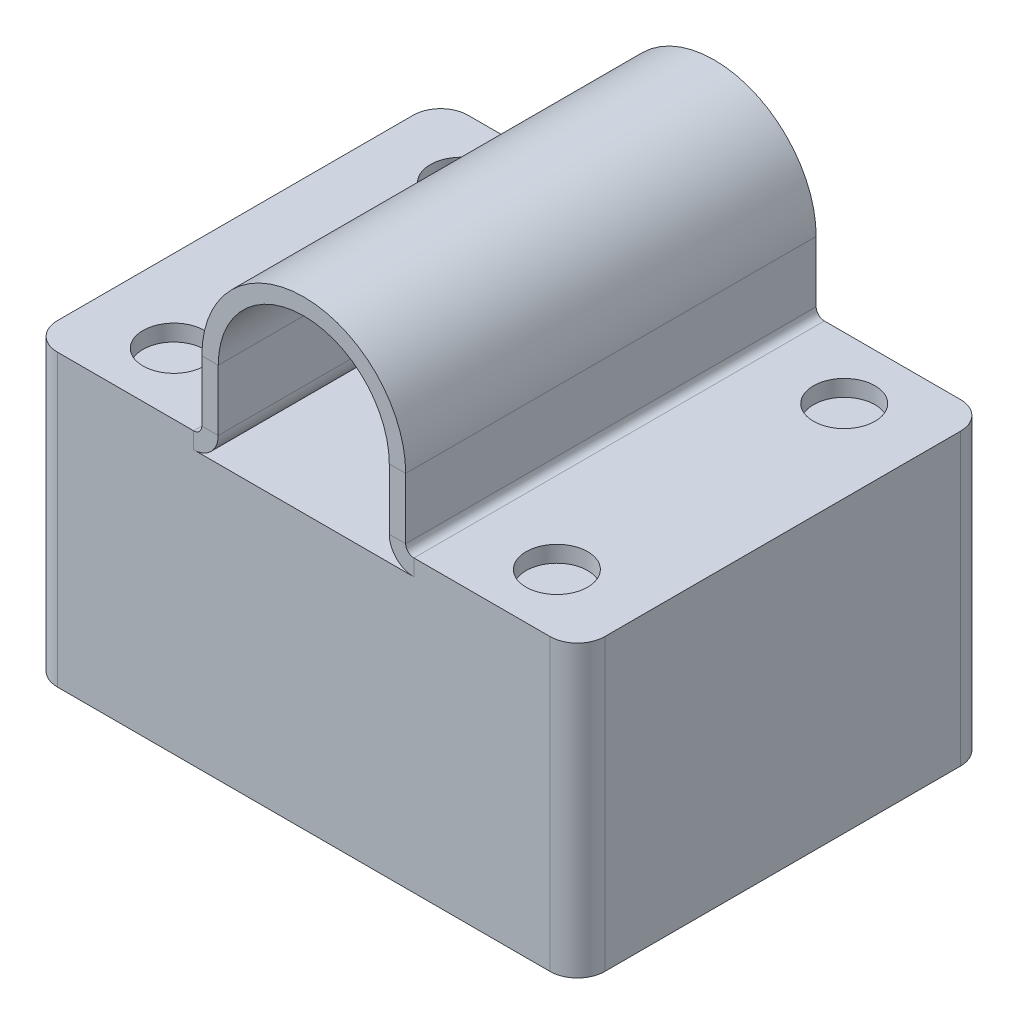
ISO-10303-21;
HEADER;
FILE_DESCRIPTION(('STEP AP214'),'2;1');
FILE_NAME('part.step','',(''),(''),'','','');
FILE_SCHEMA(('AUTOMOTIVE_DESIGN { 1 0 10303 214 1 1 1 1 }'));
ENDSEC;
DATA;
#1=APPLICATION_CONTEXT('core data for automotive mechanical design processes');
#2=APPLICATION_PROTOCOL_DEFINITION('international standard','automotive_design',2000,#1);
#3=PRODUCT_CONTEXT('',#1,'mechanical');
#4=PRODUCT('Part','Part','',(#3));
#5=PRODUCT_RELATED_PRODUCT_CATEGORY('part','',(#4));
#6=PRODUCT_DEFINITION_FORMATION('','',#4);
#7=PRODUCT_DEFINITION_CONTEXT('part definition',#1,'design');
#8=PRODUCT_DEFINITION('design','',#6,#7);
#9=PRODUCT_DEFINITION_SHAPE('','',#8);
#10=(LENGTH_UNIT() NAMED_UNIT(*) SI_UNIT(.MILLI.,.METRE.));
#11=(NAMED_UNIT(*) PLANE_ANGLE_UNIT() SI_UNIT($,.RADIAN.));
#12=(NAMED_UNIT(*) SI_UNIT($,.STERADIAN.) SOLID_ANGLE_UNIT());
#13=UNCERTAINTY_MEASURE_WITH_UNIT(LENGTH_MEASURE(1.E-05),#10,'distance_accuracy_value','');
#14=(GEOMETRIC_REPRESENTATION_CONTEXT(3) GLOBAL_UNCERTAINTY_ASSIGNED_CONTEXT((#13)) GLOBAL_UNIT_ASSIGNED_CONTEXT((#10,
#11,#12)) REPRESENTATION_CONTEXT('',''));
#15=CARTESIAN_POINT('',(0.,0.,0.));
#16=DIRECTION('',(0.,0.,1.));
#17=DIRECTION('',(1.,0.,0.));
#18=AXIS2_PLACEMENT_3D('',#15,#16,#17);
#19=CARTESIAN_POINT('',(0.,6.25,15.));
#20=DIRECTION('',(0.,0.,-1.));
#21=DIRECTION('',(-1.,0.,0.));
#22=AXIS2_PLACEMENT_3D('',#19,#20,#21);
#23=PLANE('',#22);
#24=DIRECTION('',(-1.,0.,0.));
#25=VECTOR('',#24,1.);
#26=CARTESIAN_POINT('',(-7.45,6.25,15.));
#27=LINE('',#26,#25);
#28=CARTESIAN_POINT('',(-6.25,6.25,15.));
#29=VERTEX_POINT('',#28);
#30=CARTESIAN_POINT('',(-7.45,6.25,15.));
#31=VERTEX_POINT('',#30);
#32=EDGE_CURVE('E457',#29,#31,#27,.T.);
#33=ORIENTED_EDGE('',*,*,#32,.F.);
#34=CARTESIAN_POINT('',(0.,6.25,15.));
#35=DIRECTION('',(0.,0.,1.));
#36=DIRECTION('',(1.,0.,0.));
#37=AXIS2_PLACEMENT_3D('',#34,#35,#36);
#38=CIRCLE('',#37,6.25);
#39=CARTESIAN_POINT('',(6.25,6.25,15.));
#40=VERTEX_POINT('',#39);
#41=EDGE_CURVE('E367',#40,#29,#38,.T.);
#42=ORIENTED_EDGE('',*,*,#41,.F.);
#43=DIRECTION('',(1.,0.,0.));
#44=VECTOR('',#43,1.);
#45=CARTESIAN_POINT('',(7.45,6.25,15.));
#46=LINE('',#45,#44);
#47=CARTESIAN_POINT('',(7.45,6.25,15.));
#48=VERTEX_POINT('',#47);
#49=EDGE_CURVE('E454',#40,#48,#46,.T.);
#50=ORIENTED_EDGE('',*,*,#49,.T.);
#51=CARTESIAN_POINT('',(0.,6.25,15.));
#52=DIRECTION('',(0.,0.,1.));
#53=DIRECTION('',(1.,0.,0.));
#54=AXIS2_PLACEMENT_3D('',#51,#52,#53);
#55=CIRCLE('',#54,7.45);
#56=EDGE_CURVE('E331',#48,#31,#55,.T.);
#57=ORIENTED_EDGE('',*,*,#56,.T.);
#58=EDGE_LOOP('',(#33,#42,#50,#57));
#59=FACE_BOUND('',#58,.T.);
#60=ADVANCED_FACE('F47',(#59),#23,.F.);
#61=CARTESIAN_POINT('',(7.45,6.25,15.));
#62=DIRECTION('',(0.,0.,-1.));
#63=DIRECTION('',(0.,1.,0.));
#64=AXIS2_PLACEMENT_3D('',#61,#62,#63);
#65=PLANE('',#64);
#66=ORIENTED_EDGE('',*,*,#49,.F.);
#67=DIRECTION('',(0.,1.,0.));
#68=VECTOR('',#67,1.);
#69=CARTESIAN_POINT('',(6.25,6.25,15.));
#70=LINE('',#69,#68);
#71=CARTESIAN_POINT('',(6.25,1.8,15.));
#72=VERTEX_POINT('',#71);
#73=EDGE_CURVE('E390',#72,#40,#70,.T.);
#74=ORIENTED_EDGE('',*,*,#73,.F.);
#75=DIRECTION('',(1.,0.,0.));
#76=VECTOR('',#75,1.);
#77=CARTESIAN_POINT('',(7.45,1.8,15.));
#78=LINE('',#77,#76);
#79=CARTESIAN_POINT('',(7.45,1.8,15.));
#80=VERTEX_POINT('',#79);
#81=EDGE_CURVE('E451',#72,#80,#78,.T.);
#82=ORIENTED_EDGE('',*,*,#81,.T.);
#83=DIRECTION('',(0.,1.,0.));
#84=VECTOR('',#83,1.);
#85=CARTESIAN_POINT('',(7.45,6.25,15.));
#86=LINE('',#85,#84);
#87=EDGE_CURVE('E291',#80,#48,#86,.T.);
#88=ORIENTED_EDGE('',*,*,#87,.T.);
#89=EDGE_LOOP('',(#66,#74,#82,#88));
#90=FACE_BOUND('',#89,.T.);
#91=ADVANCED_FACE('F552',(#90),#65,.F.);
#92=CARTESIAN_POINT('',(8.05,1.8,15.));
#93=DIRECTION('',(0.,0.,-1.));
#94=DIRECTION('',(-1.,0.,0.));
#95=AXIS2_PLACEMENT_3D('',#92,#93,#94);
#96=PLANE('',#95);
#97=ORIENTED_EDGE('',*,*,#81,.F.);
#98=CARTESIAN_POINT('',(8.05,1.8,15.));
#99=DIRECTION('',(0.,0.,1.));
#100=DIRECTION('',(1.,0.,0.));
#101=AXIS2_PLACEMENT_3D('',#98,#99,#100);
#102=CIRCLE('',#101,1.8);
#103=CARTESIAN_POINT('',(8.05,0.,15.));
#104=VERTEX_POINT('',#103);
#105=EDGE_CURVE('E384',#104,#72,#102,.F.);
#106=ORIENTED_EDGE('',*,*,#105,.F.);
#107=DIRECTION('',(0.,1.,0.));
#108=VECTOR('',#107,1.);
#109=CARTESIAN_POINT('',(8.05,1.2,15.));
#110=LINE('',#109,#108);
#111=CARTESIAN_POINT('',(8.05,1.2,15.));
#112=VERTEX_POINT('',#111);
#113=EDGE_CURVE('E447',#104,#112,#110,.T.);
#114=ORIENTED_EDGE('',*,*,#113,.T.);
#115=CARTESIAN_POINT('',(8.05,1.8,15.));
#116=DIRECTION('',(0.,0.,1.));
#117=DIRECTION('',(1.,0.,0.));
#118=AXIS2_PLACEMENT_3D('',#115,#116,#117);
#119=CIRCLE('',#118,0.599999999999999);
#120=EDGE_CURVE('E307',#112,#80,#119,.F.);
#121=ORIENTED_EDGE('',*,*,#120,.T.);
#122=EDGE_LOOP('',(#97,#106,#114,#121));
#123=FACE_BOUND('',#122,.T.);
#124=ADVANCED_FACE('F533',(#123),#96,.F.);
#125=CARTESIAN_POINT('',(20.,1.2,-15.));
#126=DIRECTION('',(-1.,0.,0.));
#127=DIRECTION('',(0.,0.,1.));
#128=AXIS2_PLACEMENT_3D('',#125,#126,#127);
#129=PLANE('',#128);
#130=DIRECTION('',(0.,1.,0.));
#131=VECTOR('',#130,1.);
#132=CARTESIAN_POINT('',(20.,1.2,13.));
#133=LINE('',#132,#131);
#134=CARTESIAN_POINT('',(20.,1.2,13.));
#135=VERTEX_POINT('',#134);
#136=CARTESIAN_POINT('',(20.,-20.,13.));
#137=VERTEX_POINT('',#136);
#138=EDGE_CURVE('E195',#135,#137,#133,.F.);
#139=ORIENTED_EDGE('',*,*,#138,.T.);
#140=DIRECTION('',(0.,0.,1.));
#141=VECTOR('',#140,1.);
#142=CARTESIAN_POINT('',(20.,-20.,13.));
#143=LINE('',#142,#141);
#144=CARTESIAN_POINT('',(20.,-20.,-13.));
#145=VERTEX_POINT('',#144);
#146=EDGE_CURVE('E218',#145,#137,#143,.T.);
#147=ORIENTED_EDGE('',*,*,#146,.F.);
#148=DIRECTION('',(0.,-1.,0.));
#149=VECTOR('',#148,1.);
#150=CARTESIAN_POINT('',(20.,1.2,-13.));
#151=LINE('',#150,#149);
#152=CARTESIAN_POINT('',(20.,1.2,-13.));
#153=VERTEX_POINT('',#152);
#154=EDGE_CURVE('E478',#145,#153,#151,.F.);
#155=ORIENTED_EDGE('',*,*,#154,.T.);
#156=DIRECTION('',(0.,0.,1.));
#157=VECTOR('',#156,1.);
#158=CARTESIAN_POINT('',(20.,1.2,-15.));
#159=LINE('',#158,#157);
#160=EDGE_CURVE('E279',#153,#135,#159,.T.);
#161=ORIENTED_EDGE('',*,*,#160,.T.);
#162=EDGE_LOOP('',(#139,#147,#155,#161));
#163=FACE_BOUND('',#162,.T.);
#164=ADVANCED_FACE('F489',(#163),#129,.F.);
#165=CARTESIAN_POINT('',(8.05,1.8,-15.));
#166=DIRECTION('',(0.,0.,-1.));
#167=DIRECTION('',(-1.,0.,0.));
#168=AXIS2_PLACEMENT_3D('',#165,#166,#167);
#169=PLANE('',#168);
#170=DIRECTION('',(0.,1.,0.));
#171=VECTOR('',#170,1.);
#172=CARTESIAN_POINT('',(8.05,1.2,-15.));
#173=LINE('',#172,#171);
#174=CARTESIAN_POINT('',(8.05,0.,-15.));
#175=VERTEX_POINT('',#174);
#176=CARTESIAN_POINT('',(8.05,1.2,-15.));
#177=VERTEX_POINT('',#176);
#178=EDGE_CURVE('E443',#175,#177,#173,.T.);
#179=ORIENTED_EDGE('',*,*,#178,.F.);
#180=CARTESIAN_POINT('',(8.05,1.8,-15.));
#181=DIRECTION('',(0.,0.,1.));
#182=DIRECTION('',(1.,0.,0.));
#183=AXIS2_PLACEMENT_3D('',#180,#181,#182);
#184=CIRCLE('',#183,1.8);
#185=CARTESIAN_POINT('',(6.25,1.8,-15.));
#186=VERTEX_POINT('',#185);
#187=EDGE_CURVE('E409',#175,#186,#184,.F.);
#188=ORIENTED_EDGE('',*,*,#187,.T.);
#189=DIRECTION('',(1.,0.,0.));
#190=VECTOR('',#189,1.);
#191=CARTESIAN_POINT('',(7.45,1.8,-15.));
#192=LINE('',#191,#190);
#193=CARTESIAN_POINT('',(7.45,1.8,-15.));
#194=VERTEX_POINT('',#193);
#195=EDGE_CURVE('E440',#186,#194,#192,.T.);
#196=ORIENTED_EDGE('',*,*,#195,.T.);
#197=CARTESIAN_POINT('',(8.05,1.8,-15.));
#198=DIRECTION('',(0.,0.,1.));
#199=DIRECTION('',(1.,0.,0.));
#200=AXIS2_PLACEMENT_3D('',#197,#198,#199);
#201=CIRCLE('',#200,0.599999999999999);
#202=EDGE_CURVE('E311',#177,#194,#201,.F.);
#203=ORIENTED_EDGE('',*,*,#202,.F.);
#204=EDGE_LOOP('',(#179,#188,#196,#203));
#205=FACE_BOUND('',#204,.T.);
#206=ADVANCED_FACE('F526',(#205),#169,.T.);
#207=CARTESIAN_POINT('',(7.45,6.25,-15.));
#208=DIRECTION('',(0.,0.,-1.));
#209=DIRECTION('',(0.,1.,0.));
#210=AXIS2_PLACEMENT_3D('',#207,#208,#209);
#211=PLANE('',#210);
#212=ORIENTED_EDGE('',*,*,#195,.F.);
#213=DIRECTION('',(0.,1.,0.));
#214=VECTOR('',#213,1.);
#215=CARTESIAN_POINT('',(6.25,6.25,-15.));
#216=LINE('',#215,#214);
#217=CARTESIAN_POINT('',(6.25,6.25,-15.));
#218=VERTEX_POINT('',#217);
#219=EDGE_CURVE('E385',#186,#218,#216,.T.);
#220=ORIENTED_EDGE('',*,*,#219,.T.);
#221=DIRECTION('',(1.,0.,0.));
#222=VECTOR('',#221,1.);
#223=CARTESIAN_POINT('',(7.45,6.25,-15.));
#224=LINE('',#223,#222);
#225=CARTESIAN_POINT('',(7.45,6.25,-15.));
#226=VERTEX_POINT('',#225);
#227=EDGE_CURVE('E437',#218,#226,#224,.T.);
#228=ORIENTED_EDGE('',*,*,#227,.T.);
#229=DIRECTION('',(0.,1.,0.));
#230=VECTOR('',#229,1.);
#231=CARTESIAN_POINT('',(7.45,6.25,-15.));
#232=LINE('',#231,#230);
#233=EDGE_CURVE('E299',#194,#226,#232,.T.);
#234=ORIENTED_EDGE('',*,*,#233,.F.);
#235=EDGE_LOOP('',(#212,#220,#228,#234));
#236=FACE_BOUND('',#235,.T.);
#237=ADVANCED_FACE('F545',(#236),#211,.T.);
#238=CARTESIAN_POINT('',(0.,6.25,-15.));
#239=DIRECTION('',(0.,0.,-1.));
#240=DIRECTION('',(-1.,0.,0.));
#241=AXIS2_PLACEMENT_3D('',#238,#239,#240);
#242=PLANE('',#241);
#243=ORIENTED_EDGE('',*,*,#227,.F.);
#244=CARTESIAN_POINT('',(0.,6.25,-15.));
#245=DIRECTION('',(0.,0.,1.));
#246=DIRECTION('',(1.,0.,0.));
#247=AXIS2_PLACEMENT_3D('',#244,#245,#246);
#248=CIRCLE('',#247,6.25);
#249=CARTESIAN_POINT('',(-6.25,6.25,-15.));
#250=VERTEX_POINT('',#249);
#251=EDGE_CURVE('E374',#218,#250,#248,.T.);
#252=ORIENTED_EDGE('',*,*,#251,.T.);
#253=DIRECTION('',(-1.,0.,0.));
#254=VECTOR('',#253,1.);
#255=CARTESIAN_POINT('',(-7.45,6.25,-15.));
#256=LINE('',#255,#254);
#257=CARTESIAN_POINT('',(-7.45,6.25,-15.));
#258=VERTEX_POINT('',#257);
#259=EDGE_CURVE('E434',#250,#258,#256,.T.);
#260=ORIENTED_EDGE('',*,*,#259,.T.);
#261=CARTESIAN_POINT('',(0.,6.25,-15.));
#262=DIRECTION('',(0.,0.,1.));
#263=DIRECTION('',(1.,0.,0.));
#264=AXIS2_PLACEMENT_3D('',#261,#262,#263);
#265=CIRCLE('',#264,7.45);
#266=EDGE_CURVE('E335',#226,#258,#265,.T.);
#267=ORIENTED_EDGE('',*,*,#266,.F.);
#268=EDGE_LOOP('',(#243,#252,#260,#267));
#269=FACE_BOUND('',#268,.T.);
#270=ADVANCED_FACE('F963',(#269),#242,.T.);
#271=CARTESIAN_POINT('',(-7.45,6.25,-15.));
#272=DIRECTION('',(0.,0.,-1.));
#273=DIRECTION('',(0.,-1.,0.));
#274=AXIS2_PLACEMENT_3D('',#271,#272,#273);
#275=PLANE('',#274);
#276=ORIENTED_EDGE('',*,*,#259,.F.);
#277=DIRECTION('',(0.,-1.,0.));
#278=VECTOR('',#277,1.);
#279=CARTESIAN_POINT('',(-6.25,6.25,-15.));
#280=LINE('',#279,#278);
#281=CARTESIAN_POINT('',(-6.25,1.8,-15.));
#282=VERTEX_POINT('',#281);
#283=EDGE_CURVE('E368',#250,#282,#280,.T.);
#284=ORIENTED_EDGE('',*,*,#283,.T.);
#285=DIRECTION('',(-1.,0.,0.));
#286=VECTOR('',#285,1.);
#287=CARTESIAN_POINT('',(-7.45,1.8,-15.));
#288=LINE('',#287,#286);
#289=CARTESIAN_POINT('',(-7.45,1.8,-15.));
#290=VERTEX_POINT('',#289);
#291=EDGE_CURVE('E431',#282,#290,#288,.T.);
#292=ORIENTED_EDGE('',*,*,#291,.T.);
#293=DIRECTION('',(0.,-1.,0.));
#294=VECTOR('',#293,1.);
#295=CARTESIAN_POINT('',(-7.45,6.25,-15.));
#296=LINE('',#295,#294);
#297=EDGE_CURVE('E323',#258,#290,#296,.T.);
#298=ORIENTED_EDGE('',*,*,#297,.F.);
#299=EDGE_LOOP('',(#276,#284,#292,#298));
#300=FACE_BOUND('',#299,.T.);
#301=ADVANCED_FACE('F953',(#300),#275,.T.);
#302=CARTESIAN_POINT('',(-8.05,1.8,-15.));
#303=DIRECTION('',(0.,0.,-1.));
#304=DIRECTION('',(-1.,0.,0.));
#305=AXIS2_PLACEMENT_3D('',#302,#303,#304);
#306=PLANE('',#305);
#307=ORIENTED_EDGE('',*,*,#291,.F.);
#308=CARTESIAN_POINT('',(-8.05,1.8,-15.));
#309=DIRECTION('',(0.,0.,1.));
#310=DIRECTION('',(1.,0.,0.));
#311=AXIS2_PLACEMENT_3D('',#308,#309,#310);
#312=CIRCLE('',#311,1.8);
#313=CARTESIAN_POINT('',(-8.05,0.,-15.));
#314=VERTEX_POINT('',#313);
#315=EDGE_CURVE('E280',#282,#314,#312,.F.);
#316=ORIENTED_EDGE('',*,*,#315,.T.);
#317=DIRECTION('',(0.,1.,0.));
#318=VECTOR('',#317,1.);
#319=CARTESIAN_POINT('',(-8.05,1.2,-15.));
#320=LINE('',#319,#318);
#321=CARTESIAN_POINT('',(-8.05,1.2,-15.));
#322=VERTEX_POINT('',#321);
#323=EDGE_CURVE('E428',#314,#322,#320,.T.);
#324=ORIENTED_EDGE('',*,*,#323,.T.);
#325=CARTESIAN_POINT('',(-8.05,1.8,-15.));
#326=DIRECTION('',(0.,0.,1.));
#327=DIRECTION('',(1.,0.,0.));
#328=AXIS2_PLACEMENT_3D('',#325,#326,#327);
#329=CIRCLE('',#328,0.599999999999999);
#330=EDGE_CURVE('E358',#290,#322,#329,.F.);
#331=ORIENTED_EDGE('',*,*,#330,.F.);
#332=EDGE_LOOP('',(#307,#316,#324,#331));
#333=FACE_BOUND('',#332,.T.);
#334=ADVANCED_FACE('F514',(#333),#306,.T.);
#335=CARTESIAN_POINT('',(-20.,1.2,-15.));
#336=DIRECTION('',(0.,0.,1.));
#337=DIRECTION('',(1.,0.,0.));
#338=AXIS2_PLACEMENT_3D('',#335,#336,#337);
#339=PLANE('',#338);
#340=ORIENTED_EDGE('',*,*,#323,.F.);
#341=DIRECTION('',(-1.,0.,0.));
#342=VECTOR('',#341,1.);
#343=CARTESIAN_POINT('',(-8.05,0.,-15.));
#344=LINE('',#343,#342);
#345=EDGE_CURVE('E239',#175,#314,#344,.T.);
#346=ORIENTED_EDGE('',*,*,#345,.F.);
#347=ORIENTED_EDGE('',*,*,#178,.T.);
#348=DIRECTION('',(1.,0.,0.));
#349=VECTOR('',#348,1.);
#350=CARTESIAN_POINT('',(20.,1.2,-15.));
#351=LINE('',#350,#349);
#352=CARTESIAN_POINT('',(18.,1.2,-15.));
#353=VERTEX_POINT('',#352);
#354=EDGE_CURVE('E284',#353,#177,#351,.F.);
#355=ORIENTED_EDGE('',*,*,#354,.F.);
#356=DIRECTION('',(0.,-1.,0.));
#357=VECTOR('',#356,1.);
#358=CARTESIAN_POINT('',(18.,1.2,-15.));
#359=LINE('',#358,#357);
#360=CARTESIAN_POINT('',(18.,-20.,-15.));
#361=VERTEX_POINT('',#360);
#362=EDGE_CURVE('E56',#353,#361,#359,.T.);
#363=ORIENTED_EDGE('',*,*,#362,.T.);
#364=DIRECTION('',(1.,0.,0.));
#365=VECTOR('',#364,1.);
#366=CARTESIAN_POINT('',(18.,-20.,-15.));
#367=LINE('',#366,#365);
#368=CARTESIAN_POINT('',(-18.,-20.,-15.));
#369=VERTEX_POINT('',#368);
#370=EDGE_CURVE('E199',#369,#361,#367,.T.);
#371=ORIENTED_EDGE('',*,*,#370,.F.);
#372=DIRECTION('',(0.,1.,0.));
#373=VECTOR('',#372,1.);
#374=CARTESIAN_POINT('',(-18.,1.2,-15.));
#375=LINE('',#374,#373);
#376=CARTESIAN_POINT('',(-18.,1.2,-15.));
#377=VERTEX_POINT('',#376);
#378=EDGE_CURVE('E184',#369,#377,#375,.T.);
#379=ORIENTED_EDGE('',*,*,#378,.T.);
#380=DIRECTION('',(1.,0.,0.));
#381=VECTOR('',#380,1.);
#382=CARTESIAN_POINT('',(-20.,1.2,-15.));
#383=LINE('',#382,#381);
#384=EDGE_CURVE('E347',#322,#377,#383,.F.);
#385=ORIENTED_EDGE('',*,*,#384,.F.);
#386=EDGE_LOOP('',(#340,#346,#347,#355,#363,#371,#379,#385));
#387=FACE_BOUND('',#386,.T.);
#388=ADVANCED_FACE('F200',(#387),#339,.F.);
#389=CARTESIAN_POINT('',(-20.,1.2,-15.));
#390=DIRECTION('',(-1.,0.,0.));
#391=DIRECTION('',(0.,0.,1.));
#392=AXIS2_PLACEMENT_3D('',#389,#390,#391);
#393=PLANE('',#392);
#394=DIRECTION('',(0.,-1.,0.));
#395=VECTOR('',#394,1.);
#396=CARTESIAN_POINT('',(-20.,1.2,-13.));
#397=LINE('',#396,#395);
#398=CARTESIAN_POINT('',(-20.,1.2,-13.));
#399=VERTEX_POINT('',#398);
#400=CARTESIAN_POINT('',(-20.,-20.,-13.));
#401=VERTEX_POINT('',#400);
#402=EDGE_CURVE('E460',#399,#401,#397,.T.);
#403=ORIENTED_EDGE('',*,*,#402,.T.);
#404=DIRECTION('',(0.,0.,-1.));
#405=VECTOR('',#404,1.);
#406=CARTESIAN_POINT('',(-20.,-20.,-13.));
#407=LINE('',#406,#405);
#408=CARTESIAN_POINT('',(-20.,-20.,13.));
#409=VERTEX_POINT('',#408);
#410=EDGE_CURVE('E212',#409,#401,#407,.T.);
#411=ORIENTED_EDGE('',*,*,#410,.F.);
#412=DIRECTION('',(0.,1.,0.));
#413=VECTOR('',#412,1.);
#414=CARTESIAN_POINT('',(-20.,1.2,13.));
#415=LINE('',#414,#413);
#416=CARTESIAN_POINT('',(-20.,1.2,13.));
#417=VERTEX_POINT('',#416);
#418=EDGE_CURVE('E465',#409,#417,#415,.T.);
#419=ORIENTED_EDGE('',*,*,#418,.T.);
#420=DIRECTION('',(0.,0.,1.));
#421=VECTOR('',#420,1.);
#422=CARTESIAN_POINT('',(-20.,1.2,-15.));
#423=LINE('',#422,#421);
#424=EDGE_CURVE('E350',#399,#417,#423,.T.);
#425=ORIENTED_EDGE('',*,*,#424,.F.);
#426=EDGE_LOOP('',(#403,#411,#419,#425));
#427=FACE_BOUND('',#426,.T.);
#428=ADVANCED_FACE('F501',(#427),#393,.T.);
#429=CARTESIAN_POINT('',(-20.,1.2,15.));
#430=DIRECTION('',(0.,0.,1.));
#431=DIRECTION('',(1.,0.,0.));
#432=AXIS2_PLACEMENT_3D('',#429,#430,#431);
#433=PLANE('',#432);
#434=DIRECTION('',(1.,0.,0.));
#435=VECTOR('',#434,1.);
#436=CARTESIAN_POINT('',(-20.,1.2,15.));
#437=LINE('',#436,#435);
#438=CARTESIAN_POINT('',(-8.05,1.2,15.));
#439=VERTEX_POINT('',#438);
#440=CARTESIAN_POINT('',(-18.,1.2,15.));
#441=VERTEX_POINT('',#440);
#442=EDGE_CURVE('E339',#439,#441,#437,.F.);
#443=ORIENTED_EDGE('',*,*,#442,.T.);
#444=DIRECTION('',(0.,1.,0.));
#445=VECTOR('',#444,1.);
#446=CARTESIAN_POINT('',(-18.,1.2,15.));
#447=LINE('',#446,#445);
#448=CARTESIAN_POINT('',(-18.,-20.,15.));
#449=VERTEX_POINT('',#448);
#450=EDGE_CURVE('E196',#441,#449,#447,.F.);
#451=ORIENTED_EDGE('',*,*,#450,.T.);
#452=DIRECTION('',(-1.,0.,0.));
#453=VECTOR('',#452,1.);
#454=CARTESIAN_POINT('',(-18.,-20.,15.));
#455=LINE('',#454,#453);
#456=CARTESIAN_POINT('',(18.,-20.,15.));
#457=VERTEX_POINT('',#456);
#458=EDGE_CURVE('E226',#457,#449,#455,.T.);
#459=ORIENTED_EDGE('',*,*,#458,.F.);
#460=DIRECTION('',(0.,-1.,0.));
#461=VECTOR('',#460,1.);
#462=CARTESIAN_POINT('',(18.,1.2,15.));
#463=LINE('',#462,#461);
#464=CARTESIAN_POINT('',(18.,1.2,15.));
#465=VERTEX_POINT('',#464);
#466=EDGE_CURVE('E11',#457,#465,#463,.F.);
#467=ORIENTED_EDGE('',*,*,#466,.T.);
#468=DIRECTION('',(1.,0.,0.));
#469=VECTOR('',#468,1.);
#470=CARTESIAN_POINT('',(20.,1.2,15.));
#471=LINE('',#470,#469);
#472=EDGE_CURVE('E276',#465,#112,#471,.F.);
#473=ORIENTED_EDGE('',*,*,#472,.T.);
#474=ORIENTED_EDGE('',*,*,#113,.F.);
#475=DIRECTION('',(1.,0.,0.));
#476=VECTOR('',#475,1.);
#477=CARTESIAN_POINT('',(18.,0.,15.));
#478=LINE('',#477,#476);
#479=CARTESIAN_POINT('',(-8.05,0.,15.));
#480=VERTEX_POINT('',#479);
#481=EDGE_CURVE('E235',#480,#104,#478,.T.);
#482=ORIENTED_EDGE('',*,*,#481,.F.);
#483=DIRECTION('',(0.,1.,0.));
#484=VECTOR('',#483,1.);
#485=CARTESIAN_POINT('',(-8.05,1.2,15.));
#486=LINE('',#485,#484);
#487=EDGE_CURVE('E425',#480,#439,#486,.T.);
#488=ORIENTED_EDGE('',*,*,#487,.T.);
#489=EDGE_LOOP('',(#443,#451,#459,#467,#473,#474,#482,#488));
#490=FACE_BOUND('',#489,.T.);
#491=ADVANCED_FACE('F495',(#490),#433,.T.);
#492=CARTESIAN_POINT('',(-8.05,1.8,15.));
#493=DIRECTION('',(0.,0.,-1.));
#494=DIRECTION('',(-1.,0.,0.));
#495=AXIS2_PLACEMENT_3D('',#492,#493,#494);
#496=PLANE('',#495);
#497=ORIENTED_EDGE('',*,*,#487,.F.);
#498=CARTESIAN_POINT('',(-8.05,1.8,15.));
#499=DIRECTION('',(0.,0.,1.));
#500=DIRECTION('',(1.,0.,0.));
#501=AXIS2_PLACEMENT_3D('',#498,#499,#500);
#502=CIRCLE('',#501,1.8);
#503=CARTESIAN_POINT('',(-6.25,1.8,15.));
#504=VERTEX_POINT('',#503);
#505=EDGE_CURVE('E373',#504,#480,#502,.F.);
#506=ORIENTED_EDGE('',*,*,#505,.F.);
#507=DIRECTION('',(-1.,0.,0.));
#508=VECTOR('',#507,1.);
#509=CARTESIAN_POINT('',(-7.45,1.8,15.));
#510=LINE('',#509,#508);
#511=CARTESIAN_POINT('',(-7.45,1.8,15.));
#512=VERTEX_POINT('',#511);
#513=EDGE_CURVE('E362',#504,#512,#510,.T.);
#514=ORIENTED_EDGE('',*,*,#513,.T.);
#515=CARTESIAN_POINT('',(-8.05,1.8,15.));
#516=DIRECTION('',(0.,0.,1.));
#517=DIRECTION('',(1.,0.,0.));
#518=AXIS2_PLACEMENT_3D('',#515,#516,#517);
#519=CIRCLE('',#518,0.599999999999999);
#520=EDGE_CURVE('E354',#512,#439,#519,.F.);
#521=ORIENTED_EDGE('',*,*,#520,.T.);
#522=EDGE_LOOP('',(#497,#506,#514,#521));
#523=FACE_BOUND('',#522,.T.);
#524=ADVANCED_FACE('F568',(#523),#496,.F.);
#525=CARTESIAN_POINT('',(-7.45,6.25,15.));
#526=DIRECTION('',(0.,0.,-1.));
#527=DIRECTION('',(0.,-1.,0.));
#528=AXIS2_PLACEMENT_3D('',#525,#526,#527);
#529=PLANE('',#528);
#530=DIRECTION('',(0.,-1.,0.));
#531=VECTOR('',#530,1.);
#532=CARTESIAN_POINT('',(-6.25,6.25,15.));
#533=LINE('',#532,#531);
#534=EDGE_CURVE('E379',#29,#504,#533,.T.);
#535=ORIENTED_EDGE('',*,*,#534,.F.);
#536=ORIENTED_EDGE('',*,*,#32,.T.);
#537=DIRECTION('',(0.,-1.,0.));
#538=VECTOR('',#537,1.);
#539=CARTESIAN_POINT('',(-7.45,6.25,15.));
#540=LINE('',#539,#538);
#541=EDGE_CURVE('E315',#31,#512,#540,.T.);
#542=ORIENTED_EDGE('',*,*,#541,.T.);
#543=ORIENTED_EDGE('',*,*,#513,.F.);
#544=EDGE_LOOP('',(#535,#536,#542,#543));
#545=FACE_BOUND('',#544,.T.);
#546=ADVANCED_FACE('F562',(#545),#529,.F.);
#547=CARTESIAN_POINT('',(-8.05,1.8,-15.));
#548=DIRECTION('',(0.,0.,1.));
#549=DIRECTION('',(1.,0.,0.));
#550=AXIS2_PLACEMENT_3D('',#547,#548,#549);
#551=CYLINDRICAL_SURFACE('',#550,0.599999999999999);
#552=ORIENTED_EDGE('',*,*,#520,.F.);
#553=DIRECTION('',(0.,0.,1.));
#554=VECTOR('',#553,1.);
#555=CARTESIAN_POINT('',(-7.45,1.8,-15.));
#556=LINE('',#555,#554);
#557=EDGE_CURVE('E327',#290,#512,#556,.T.);
#558=ORIENTED_EDGE('',*,*,#557,.F.);
#559=ORIENTED_EDGE('',*,*,#330,.T.);
#560=DIRECTION('',(0.,0.,1.));
#561=VECTOR('',#560,1.);
#562=CARTESIAN_POINT('',(-8.05,1.2,-15.));
#563=LINE('',#562,#561);
#564=EDGE_CURVE('E343',#322,#439,#563,.T.);
#565=ORIENTED_EDGE('',*,*,#564,.T.);
#566=EDGE_LOOP('',(#552,#558,#559,#565));
#567=FACE_BOUND('',#566,.T.);
#568=ADVANCED_FACE('F512',(#567),#551,.F.);
#569=CARTESIAN_POINT('',(-20.,1.2,-15.));
#570=DIRECTION('',(0.,1.,0.));
#571=DIRECTION('',(0.,0.,1.));
#572=AXIS2_PLACEMENT_3D('',#569,#570,#571);
#573=PLANE('',#572);
#574=CARTESIAN_POINT('',(-14.,1.2,-10.5));
#575=DIRECTION('',(0.,1.,0.));
#576=DIRECTION('',(0.,0.,1.));
#577=AXIS2_PLACEMENT_3D('',#574,#575,#576);
#578=CIRCLE('',#577,2.25);
#579=CARTESIAN_POINT('',(-14.,1.2,-8.25));
#580=VERTEX_POINT('',#579);
#581=EDGE_CURVE('E243',#580,#580,#578,.T.);
#582=ORIENTED_EDGE('',*,*,#581,.F.);
#583=EDGE_LOOP('',(#582));
#584=FACE_BOUND('',#583,.T.);
#585=CARTESIAN_POINT('',(-14.,1.2,10.5));
#586=DIRECTION('',(0.,1.,0.));
#587=DIRECTION('',(0.,0.,1.));
#588=AXIS2_PLACEMENT_3D('',#585,#586,#587);
#589=CIRCLE('',#588,2.25);
#590=CARTESIAN_POINT('',(-14.,1.2,12.75));
#591=VERTEX_POINT('',#590);
#592=EDGE_CURVE('E251',#591,#591,#589,.T.);
#593=ORIENTED_EDGE('',*,*,#592,.F.);
#594=EDGE_LOOP('',(#593));
#595=FACE_BOUND('',#594,.T.);
#596=ORIENTED_EDGE('',*,*,#424,.T.);
#597=CARTESIAN_POINT('',(-18.,1.2,13.));
#598=DIRECTION('',(0.,1.,0.));
#599=DIRECTION('',(0.,0.,1.));
#600=AXIS2_PLACEMENT_3D('',#597,#598,#599);
#601=CIRCLE('',#600,2.);
#602=EDGE_CURVE('E471',#417,#441,#601,.T.);
#603=ORIENTED_EDGE('',*,*,#602,.T.);
#604=ORIENTED_EDGE('',*,*,#442,.F.);
#605=ORIENTED_EDGE('',*,*,#564,.F.);
#606=ORIENTED_EDGE('',*,*,#384,.T.);
#607=CARTESIAN_POINT('',(-18.,1.2,-13.));
#608=DIRECTION('',(0.,1.,0.));
#609=DIRECTION('',(0.,0.,1.));
#610=AXIS2_PLACEMENT_3D('',#607,#608,#609);
#611=CIRCLE('',#610,2.);
#612=EDGE_CURVE('E190',#377,#399,#611,.T.);
#613=ORIENTED_EDGE('',*,*,#612,.T.);
#614=EDGE_LOOP('',(#596,#603,#604,#605,#606,#613));
#615=FACE_BOUND('',#614,.T.);
#616=ADVANCED_FACE('F504',(#584,#595,#615),#573,.T.);
#617=CARTESIAN_POINT('',(0.,6.25,-15.));
#618=DIRECTION('',(0.,0.,1.));
#619=DIRECTION('',(1.,0.,0.));
#620=AXIS2_PLACEMENT_3D('',#617,#618,#619);
#621=CYLINDRICAL_SURFACE('',#620,7.45);
#622=ORIENTED_EDGE('',*,*,#56,.F.);
#623=DIRECTION('',(0.,0.,1.));
#624=VECTOR('',#623,1.);
#625=CARTESIAN_POINT('',(7.45,6.25,-15.));
#626=LINE('',#625,#624);
#627=EDGE_CURVE('E303',#226,#48,#626,.T.);
#628=ORIENTED_EDGE('',*,*,#627,.F.);
#629=ORIENTED_EDGE('',*,*,#266,.T.);
#630=DIRECTION('',(0.,0.,1.));
#631=VECTOR('',#630,1.);
#632=CARTESIAN_POINT('',(-7.45,6.25,-15.));
#633=LINE('',#632,#631);
#634=EDGE_CURVE('E319',#258,#31,#633,.T.);
#635=ORIENTED_EDGE('',*,*,#634,.T.);
#636=EDGE_LOOP('',(#622,#628,#629,#635));
#637=FACE_BOUND('',#636,.T.);
#638=ADVANCED_FACE('F647',(#637),#621,.T.);
#639=CARTESIAN_POINT('',(-7.45,6.25,-15.));
#640=DIRECTION('',(-1.,0.,0.));
#641=DIRECTION('',(0.,-1.,0.));
#642=AXIS2_PLACEMENT_3D('',#639,#640,#641);
#643=PLANE('',#642);
#644=ORIENTED_EDGE('',*,*,#541,.F.);
#645=ORIENTED_EDGE('',*,*,#634,.F.);
#646=ORIENTED_EDGE('',*,*,#297,.T.);
#647=ORIENTED_EDGE('',*,*,#557,.T.);
#648=EDGE_LOOP('',(#644,#645,#646,#647));
#649=FACE_BOUND('',#648,.T.);
#650=ADVANCED_FACE('F644',(#649),#643,.T.);
#651=CARTESIAN_POINT('',(8.05,1.8,-15.));
#652=DIRECTION('',(0.,0.,1.));
#653=DIRECTION('',(1.,0.,0.));
#654=AXIS2_PLACEMENT_3D('',#651,#652,#653);
#655=CYLINDRICAL_SURFACE('',#654,0.599999999999999);
#656=ORIENTED_EDGE('',*,*,#120,.F.);
#657=DIRECTION('',(0.,0.,1.));
#658=VECTOR('',#657,1.);
#659=CARTESIAN_POINT('',(8.05,1.2,-15.));
#660=LINE('',#659,#658);
#661=EDGE_CURVE('E287',#177,#112,#660,.T.);
#662=ORIENTED_EDGE('',*,*,#661,.F.);
#663=ORIENTED_EDGE('',*,*,#202,.T.);
#664=DIRECTION('',(0.,0.,1.));
#665=VECTOR('',#664,1.);
#666=CARTESIAN_POINT('',(7.45,1.8,-15.));
#667=LINE('',#666,#665);
#668=EDGE_CURVE('E295',#194,#80,#667,.T.);
#669=ORIENTED_EDGE('',*,*,#668,.T.);
#670=EDGE_LOOP('',(#656,#662,#663,#669));
#671=FACE_BOUND('',#670,.T.);
#672=ADVANCED_FACE('F530',(#671),#655,.F.);
#673=CARTESIAN_POINT('',(7.45,6.25,-15.));
#674=DIRECTION('',(1.,0.,0.));
#675=DIRECTION('',(0.,1.,0.));
#676=AXIS2_PLACEMENT_3D('',#673,#674,#675);
#677=PLANE('',#676);
#678=ORIENTED_EDGE('',*,*,#87,.F.);
#679=ORIENTED_EDGE('',*,*,#668,.F.);
#680=ORIENTED_EDGE('',*,*,#233,.T.);
#681=ORIENTED_EDGE('',*,*,#627,.T.);
#682=EDGE_LOOP('',(#678,#679,#680,#681));
#683=FACE_BOUND('',#682,.T.);
#684=ADVANCED_FACE('F549',(#683),#677,.T.);
#685=CARTESIAN_POINT('',(20.,1.2,-15.));
#686=DIRECTION('',(0.,1.,0.));
#687=DIRECTION('',(0.,0.,1.));
#688=AXIS2_PLACEMENT_3D('',#685,#686,#687);
#689=PLANE('',#688);
#690=CARTESIAN_POINT('',(14.,1.2,10.5));
#691=DIRECTION('',(0.,1.,0.));
#692=DIRECTION('',(0.,0.,1.));
#693=AXIS2_PLACEMENT_3D('',#690,#691,#692);
#694=CIRCLE('',#693,2.25);
#695=CARTESIAN_POINT('',(14.,1.2,12.75));
#696=VERTEX_POINT('',#695);
#697=EDGE_CURVE('E259',#696,#696,#694,.T.);
#698=ORIENTED_EDGE('',*,*,#697,.F.);
#699=EDGE_LOOP('',(#698));
#700=FACE_BOUND('',#699,.T.);
#701=CARTESIAN_POINT('',(14.,1.2,-10.5));
#702=DIRECTION('',(0.,1.,0.));
#703=DIRECTION('',(0.,0.,1.));
#704=AXIS2_PLACEMENT_3D('',#701,#702,#703);
#705=CIRCLE('',#704,2.25);
#706=CARTESIAN_POINT('',(14.,1.2,-8.25000000000001));
#707=VERTEX_POINT('',#706);
#708=EDGE_CURVE('E267',#707,#707,#705,.T.);
#709=ORIENTED_EDGE('',*,*,#708,.F.);
#710=EDGE_LOOP('',(#709));
#711=FACE_BOUND('',#710,.T.);
#712=ORIENTED_EDGE('',*,*,#160,.F.);
#713=CARTESIAN_POINT('',(18.,1.2,-13.));
#714=DIRECTION('',(0.,1.,0.));
#715=DIRECTION('',(0.,0.,1.));
#716=AXIS2_PLACEMENT_3D('',#713,#714,#715);
#717=CIRCLE('',#716,2.);
#718=EDGE_CURVE('E63',#153,#353,#717,.T.);
#719=ORIENTED_EDGE('',*,*,#718,.T.);
#720=ORIENTED_EDGE('',*,*,#354,.T.);
#721=ORIENTED_EDGE('',*,*,#661,.T.);
#722=ORIENTED_EDGE('',*,*,#472,.F.);
#723=CARTESIAN_POINT('',(18.,1.2,13.));
#724=DIRECTION('',(0.,1.,0.));
#725=DIRECTION('',(0.,0.,1.));
#726=AXIS2_PLACEMENT_3D('',#723,#724,#725);
#727=CIRCLE('',#726,2.);
#728=EDGE_CURVE('E71',#465,#135,#727,.T.);
#729=ORIENTED_EDGE('',*,*,#728,.T.);
#730=EDGE_LOOP('',(#712,#719,#720,#721,#722,#729));
#731=FACE_BOUND('',#730,.T.);
#732=ADVANCED_FACE('F487',(#700,#711,#731),#689,.T.);
#733=CARTESIAN_POINT('',(-8.05,1.8,-15.));
#734=DIRECTION('',(0.,0.,1.));
#735=DIRECTION('',(1.,0.,0.));
#736=AXIS2_PLACEMENT_3D('',#733,#734,#735);
#737=CYLINDRICAL_SURFACE('',#736,1.8);
#738=ORIENTED_EDGE('',*,*,#505,.T.);
#739=DIRECTION('',(0.,0.,1.));
#740=VECTOR('',#739,1.);
#741=CARTESIAN_POINT('',(-8.05,0.,-15.));
#742=LINE('',#741,#740);
#743=EDGE_CURVE('E369',#314,#480,#742,.T.);
#744=ORIENTED_EDGE('',*,*,#743,.F.);
#745=ORIENTED_EDGE('',*,*,#315,.F.);
#746=DIRECTION('',(0.,0.,1.));
#747=VECTOR('',#746,1.);
#748=CARTESIAN_POINT('',(-6.25,1.8,-15.));
#749=LINE('',#748,#747);
#750=EDGE_CURVE('E363',#282,#504,#749,.T.);
#751=ORIENTED_EDGE('',*,*,#750,.T.);
#752=EDGE_LOOP('',(#738,#744,#745,#751));
#753=FACE_BOUND('',#752,.T.);
#754=ADVANCED_FACE('F569',(#753),#737,.T.);
#755=CARTESIAN_POINT('',(0.,6.25,-15.));
#756=DIRECTION('',(0.,0.,1.));
#757=DIRECTION('',(1.,0.,0.));
#758=AXIS2_PLACEMENT_3D('',#755,#756,#757);
#759=CYLINDRICAL_SURFACE('',#758,6.25);
#760=ORIENTED_EDGE('',*,*,#41,.T.);
#761=DIRECTION('',(0.,0.,1.));
#762=VECTOR('',#761,1.);
#763=CARTESIAN_POINT('',(-6.25,6.25,-15.));
#764=LINE('',#763,#762);
#765=EDGE_CURVE('E375',#250,#29,#764,.T.);
#766=ORIENTED_EDGE('',*,*,#765,.F.);
#767=ORIENTED_EDGE('',*,*,#251,.F.);
#768=DIRECTION('',(0.,0.,1.));
#769=VECTOR('',#768,1.);
#770=CARTESIAN_POINT('',(6.25,6.25,-15.));
#771=LINE('',#770,#769);
#772=EDGE_CURVE('E380',#218,#40,#771,.T.);
#773=ORIENTED_EDGE('',*,*,#772,.T.);
#774=EDGE_LOOP('',(#760,#766,#767,#773));
#775=FACE_BOUND('',#774,.T.);
#776=ADVANCED_FACE('F559',(#775),#759,.F.);
#777=CARTESIAN_POINT('',(-6.25,6.25,-15.));
#778=DIRECTION('',(-1.,0.,0.));
#779=DIRECTION('',(0.,-1.,0.));
#780=AXIS2_PLACEMENT_3D('',#777,#778,#779);
#781=PLANE('',#780);
#782=ORIENTED_EDGE('',*,*,#534,.T.);
#783=ORIENTED_EDGE('',*,*,#750,.F.);
#784=ORIENTED_EDGE('',*,*,#283,.F.);
#785=ORIENTED_EDGE('',*,*,#765,.T.);
#786=EDGE_LOOP('',(#782,#783,#784,#785));
#787=FACE_BOUND('',#786,.T.);
#788=ADVANCED_FACE('F566',(#787),#781,.F.);
#789=CARTESIAN_POINT('',(8.05,1.8,-15.));
#790=DIRECTION('',(0.,0.,1.));
#791=DIRECTION('',(1.,0.,0.));
#792=AXIS2_PLACEMENT_3D('',#789,#790,#791);
#793=CYLINDRICAL_SURFACE('',#792,1.8);
#794=ORIENTED_EDGE('',*,*,#105,.T.);
#795=DIRECTION('',(0.,0.,1.));
#796=VECTOR('',#795,1.);
#797=CARTESIAN_POINT('',(6.25,1.8,-15.));
#798=LINE('',#797,#796);
#799=EDGE_CURVE('E386',#186,#72,#798,.T.);
#800=ORIENTED_EDGE('',*,*,#799,.F.);
#801=ORIENTED_EDGE('',*,*,#187,.F.);
#802=DIRECTION('',(0.,0.,1.));
#803=VECTOR('',#802,1.);
#804=CARTESIAN_POINT('',(8.05,0.,-15.));
#805=LINE('',#804,#803);
#806=EDGE_CURVE('E275',#175,#104,#805,.T.);
#807=ORIENTED_EDGE('',*,*,#806,.T.);
#808=EDGE_LOOP('',(#794,#800,#801,#807));
#809=FACE_BOUND('',#808,.T.);
#810=ADVANCED_FACE('F536',(#809),#793,.T.);
#811=CARTESIAN_POINT('',(6.25,6.25,-15.));
#812=DIRECTION('',(1.,0.,0.));
#813=DIRECTION('',(0.,1.,0.));
#814=AXIS2_PLACEMENT_3D('',#811,#812,#813);
#815=PLANE('',#814);
#816=ORIENTED_EDGE('',*,*,#73,.T.);
#817=ORIENTED_EDGE('',*,*,#772,.F.);
#818=ORIENTED_EDGE('',*,*,#219,.F.);
#819=ORIENTED_EDGE('',*,*,#799,.T.);
#820=EDGE_LOOP('',(#816,#817,#818,#819));
#821=FACE_BOUND('',#820,.T.);
#822=ADVANCED_FACE('F542',(#821),#815,.F.);
#823=CARTESIAN_POINT('',(14.,1.2,-10.5));
#824=DIRECTION('',(0.,1.,0.));
#825=DIRECTION('',(0.,0.,1.));
#826=AXIS2_PLACEMENT_3D('',#823,#824,#825);
#827=CYLINDRICAL_SURFACE('',#826,2.25);
#828=CARTESIAN_POINT('',(14.,0.,-10.5));
#829=DIRECTION('',(0.,1.,0.));
#830=DIRECTION('',(0.,0.,1.));
#831=AXIS2_PLACEMENT_3D('',#828,#829,#830);
#832=CIRCLE('',#831,2.25);
#833=CARTESIAN_POINT('',(14.,0.,-8.25000000000001));
#834=VERTEX_POINT('',#833);
#835=EDGE_CURVE('E271',#834,#834,#832,.T.);
#836=ORIENTED_EDGE('',*,*,#835,.F.);
#837=EDGE_LOOP('',(#836));
#838=FACE_BOUND('',#837,.T.);
#839=ORIENTED_EDGE('',*,*,#708,.T.);
#840=EDGE_LOOP('',(#839));
#841=FACE_BOUND('',#840,.T.);
#842=ADVANCED_FACE('F623',(#838,#841),#827,.F.);
#843=CARTESIAN_POINT('',(14.,1.2,10.5));
#844=DIRECTION('',(0.,1.,0.));
#845=DIRECTION('',(0.,0.,1.));
#846=AXIS2_PLACEMENT_3D('',#843,#844,#845);
#847=CYLINDRICAL_SURFACE('',#846,2.25);
#848=CARTESIAN_POINT('',(14.,0.,10.5));
#849=DIRECTION('',(0.,1.,0.));
#850=DIRECTION('',(0.,0.,1.));
#851=AXIS2_PLACEMENT_3D('',#848,#849,#850);
#852=CIRCLE('',#851,2.25);
#853=CARTESIAN_POINT('',(14.,0.,12.75));
#854=VERTEX_POINT('',#853);
#855=EDGE_CURVE('E263',#854,#854,#852,.T.);
#856=ORIENTED_EDGE('',*,*,#855,.F.);
#857=EDGE_LOOP('',(#856));
#858=FACE_BOUND('',#857,.T.);
#859=ORIENTED_EDGE('',*,*,#697,.T.);
#860=EDGE_LOOP('',(#859));
#861=FACE_BOUND('',#860,.T.);
#862=ADVANCED_FACE('F626',(#858,#861),#847,.F.);
#863=CARTESIAN_POINT('',(-14.,1.2,10.5));
#864=DIRECTION('',(0.,1.,0.));
#865=DIRECTION('',(0.,0.,1.));
#866=AXIS2_PLACEMENT_3D('',#863,#864,#865);
#867=CYLINDRICAL_SURFACE('',#866,2.25);
#868=CARTESIAN_POINT('',(-14.,0.,10.5));
#869=DIRECTION('',(0.,1.,0.));
#870=DIRECTION('',(0.,0.,1.));
#871=AXIS2_PLACEMENT_3D('',#868,#869,#870);
#872=CIRCLE('',#871,2.25);
#873=CARTESIAN_POINT('',(-14.,0.,12.75));
#874=VERTEX_POINT('',#873);
#875=EDGE_CURVE('E255',#874,#874,#872,.T.);
#876=ORIENTED_EDGE('',*,*,#875,.F.);
#877=EDGE_LOOP('',(#876));
#878=FACE_BOUND('',#877,.T.);
#879=ORIENTED_EDGE('',*,*,#592,.T.);
#880=EDGE_LOOP('',(#879));
#881=FACE_BOUND('',#880,.T.);
#882=ADVANCED_FACE('F634',(#878,#881),#867,.F.);
#883=CARTESIAN_POINT('',(-14.,1.2,-10.5));
#884=DIRECTION('',(0.,1.,0.));
#885=DIRECTION('',(0.,0.,1.));
#886=AXIS2_PLACEMENT_3D('',#883,#884,#885);
#887=CYLINDRICAL_SURFACE('',#886,2.25);
#888=CARTESIAN_POINT('',(-14.,0.,-10.5));
#889=DIRECTION('',(0.,1.,0.));
#890=DIRECTION('',(0.,0.,1.));
#891=AXIS2_PLACEMENT_3D('',#888,#889,#890);
#892=CIRCLE('',#891,2.25);
#893=CARTESIAN_POINT('',(-14.,0.,-8.25));
#894=VERTEX_POINT('',#893);
#895=EDGE_CURVE('E247',#894,#894,#892,.T.);
#896=ORIENTED_EDGE('',*,*,#895,.F.);
#897=EDGE_LOOP('',(#896));
#898=FACE_BOUND('',#897,.T.);
#899=ORIENTED_EDGE('',*,*,#581,.T.);
#900=EDGE_LOOP('',(#899));
#901=FACE_BOUND('',#900,.T.);
#902=ADVANCED_FACE('F592',(#898,#901),#887,.F.);
#903=CARTESIAN_POINT('',(-18.,1.2,13.));
#904=DIRECTION('',(0.,1.,0.));
#905=DIRECTION('',(0.,0.,1.));
#906=AXIS2_PLACEMENT_3D('',#903,#904,#905);
#907=CYLINDRICAL_SURFACE('',#906,2.);
#908=ORIENTED_EDGE('',*,*,#418,.F.);
#909=CARTESIAN_POINT('',(-18.,-20.,13.));
#910=DIRECTION('',(0.,-1.,0.));
#911=DIRECTION('',(0.,0.,-1.));
#912=AXIS2_PLACEMENT_3D('',#909,#910,#911);
#913=CIRCLE('',#912,2.);
#914=EDGE_CURVE('E230',#449,#409,#913,.T.);
#915=ORIENTED_EDGE('',*,*,#914,.F.);
#916=ORIENTED_EDGE('',*,*,#450,.F.);
#917=ORIENTED_EDGE('',*,*,#602,.F.);
#918=EDGE_LOOP('',(#908,#915,#916,#917));
#919=FACE_BOUND('',#918,.T.);
#920=ADVANCED_FACE('F499',(#919),#907,.T.);
#921=CARTESIAN_POINT('',(-18.,1.2,-13.));
#922=DIRECTION('',(0.,-1.,0.));
#923=DIRECTION('',(0.,0.,-1.));
#924=AXIS2_PLACEMENT_3D('',#921,#922,#923);
#925=CYLINDRICAL_SURFACE('',#924,2.);
#926=ORIENTED_EDGE('',*,*,#378,.F.);
#927=CARTESIAN_POINT('',(-18.,-20.,-13.));
#928=DIRECTION('',(0.,-1.,0.));
#929=DIRECTION('',(0.,0.,-1.));
#930=AXIS2_PLACEMENT_3D('',#927,#928,#929);
#931=CIRCLE('',#930,2.);
#932=EDGE_CURVE('E189',#401,#369,#931,.T.);
#933=ORIENTED_EDGE('',*,*,#932,.F.);
#934=ORIENTED_EDGE('',*,*,#402,.F.);
#935=ORIENTED_EDGE('',*,*,#612,.F.);
#936=EDGE_LOOP('',(#926,#933,#934,#935));
#937=FACE_BOUND('',#936,.T.);
#938=ADVANCED_FACE('F186',(#937),#925,.T.);
#939=CARTESIAN_POINT('',(18.,1.2,-13.));
#940=DIRECTION('',(0.,1.,0.));
#941=DIRECTION('',(0.,0.,1.));
#942=AXIS2_PLACEMENT_3D('',#939,#940,#941);
#943=CYLINDRICAL_SURFACE('',#942,2.);
#944=ORIENTED_EDGE('',*,*,#154,.F.);
#945=CARTESIAN_POINT('',(18.,-20.,-13.));
#946=DIRECTION('',(0.,-1.,0.));
#947=DIRECTION('',(0.,0.,-1.));
#948=AXIS2_PLACEMENT_3D('',#945,#946,#947);
#949=CIRCLE('',#948,2.);
#950=EDGE_CURVE('E206',#361,#145,#949,.T.);
#951=ORIENTED_EDGE('',*,*,#950,.F.);
#952=ORIENTED_EDGE('',*,*,#362,.F.);
#953=ORIENTED_EDGE('',*,*,#718,.F.);
#954=EDGE_LOOP('',(#944,#951,#952,#953));
#955=FACE_BOUND('',#954,.T.);
#956=ADVANCED_FACE('F594',(#955),#943,.T.);
#957=CARTESIAN_POINT('',(18.,1.2,13.));
#958=DIRECTION('',(0.,-1.,0.));
#959=DIRECTION('',(0.,0.,-1.));
#960=AXIS2_PLACEMENT_3D('',#957,#958,#959);
#961=CYLINDRICAL_SURFACE('',#960,2.);
#962=ORIENTED_EDGE('',*,*,#466,.F.);
#963=CARTESIAN_POINT('',(18.,-20.,13.));
#964=DIRECTION('',(0.,-1.,0.));
#965=DIRECTION('',(0.,0.,-1.));
#966=AXIS2_PLACEMENT_3D('',#963,#964,#965);
#967=CIRCLE('',#966,2.);
#968=EDGE_CURVE('E222',#137,#457,#967,.T.);
#969=ORIENTED_EDGE('',*,*,#968,.F.);
#970=ORIENTED_EDGE('',*,*,#138,.F.);
#971=ORIENTED_EDGE('',*,*,#728,.F.);
#972=EDGE_LOOP('',(#962,#969,#970,#971));
#973=FACE_BOUND('',#972,.T.);
#974=ADVANCED_FACE('F49',(#973),#961,.T.);
#975=CARTESIAN_POINT('',(-18.,0.,13.));
#976=DIRECTION('',(0.,1.,0.));
#977=DIRECTION('',(0.,0.,1.));
#978=AXIS2_PLACEMENT_3D('',#975,#976,#977);
#979=PLANE('',#978);
#980=ORIENTED_EDGE('',*,*,#345,.T.);
#981=ORIENTED_EDGE('',*,*,#743,.T.);
#982=ORIENTED_EDGE('',*,*,#481,.T.);
#983=ORIENTED_EDGE('',*,*,#806,.F.);
#984=EDGE_LOOP('',(#980,#981,#982,#983));
#985=FACE_BOUND('',#984,.T.);
#986=ADVANCED_FACE('F520',(#985),#979,.T.);
#987=ORIENTED_EDGE('',*,*,#895,.T.);
#988=EDGE_LOOP('',(#987));
#989=FACE_BOUND('',#988,.T.);
#990=ADVANCED_FACE('F603',(#989),#979,.T.);
#991=ORIENTED_EDGE('',*,*,#875,.T.);
#992=EDGE_LOOP('',(#991));
#993=FACE_BOUND('',#992,.T.);
#994=ADVANCED_FACE('F609',(#993),#979,.T.);
#995=ORIENTED_EDGE('',*,*,#855,.T.);
#996=EDGE_LOOP('',(#995));
#997=FACE_BOUND('',#996,.T.);
#998=ADVANCED_FACE('F614',(#997),#979,.T.);
#999=ORIENTED_EDGE('',*,*,#835,.T.);
#1000=EDGE_LOOP('',(#999));
#1001=FACE_BOUND('',#1000,.T.);
#1002=ADVANCED_FACE('F605',(#1001),#979,.T.);
#1003=CARTESIAN_POINT('',(-18.,-20.,-13.));
#1004=DIRECTION('',(0.,-1.,0.));
#1005=DIRECTION('',(0.,0.,-1.));
#1006=AXIS2_PLACEMENT_3D('',#1003,#1004,#1005);
#1007=PLANE('',#1006);
#1008=ORIENTED_EDGE('',*,*,#932,.T.);
#1009=ORIENTED_EDGE('',*,*,#370,.T.);
#1010=ORIENTED_EDGE('',*,*,#950,.T.);
#1011=ORIENTED_EDGE('',*,*,#146,.T.);
#1012=ORIENTED_EDGE('',*,*,#968,.T.);
#1013=ORIENTED_EDGE('',*,*,#458,.T.);
#1014=ORIENTED_EDGE('',*,*,#914,.T.);
#1015=ORIENTED_EDGE('',*,*,#410,.T.);
#1016=EDGE_LOOP('',(#1008,#1009,#1010,#1011,#1012,#1013,#1014,#1015));
#1017=FACE_BOUND('',#1016,.T.);
#1018=ADVANCED_FACE('F209',(#1017),#1007,.T.);
#1019=CLOSED_SHELL('',(#60,#91,#124,#164,#206,#237,#270,#301,#334,#388,#428,#491,#524,#546,#568,
#616,#638,#650,#672,#684,#732,#754,#776,#788,#810,#822,#842,#862,#882,#902,#920,#938,#956,#974,
#986,#990,#994,#998,#1002,#1018));
#1020=MANIFOLD_SOLID_BREP('B2',#1019);
#1021=ADVANCED_BREP_SHAPE_REPRESENTATION('',(#18,#1020),#14);
#1022=SHAPE_DEFINITION_REPRESENTATION(#9,#1021);
ENDSEC;
END-ISO-10303-21;
